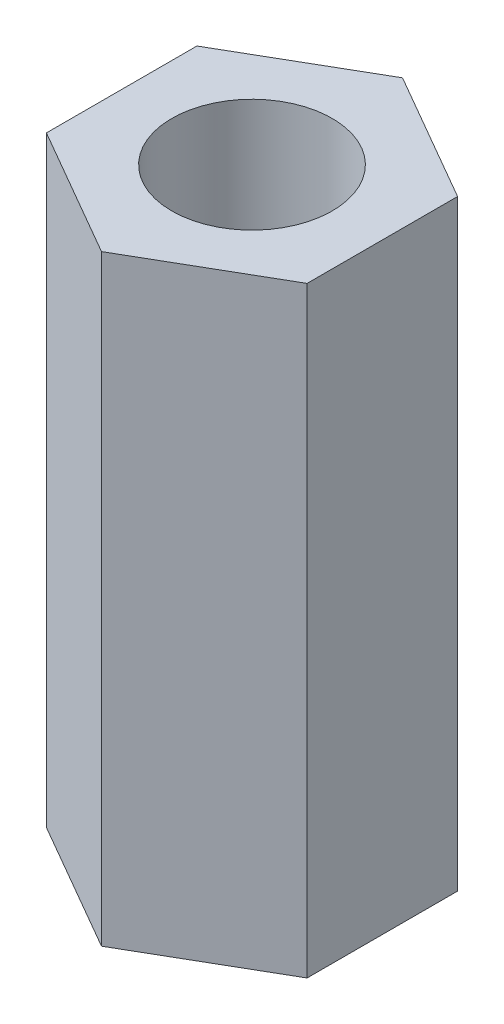
ISO-10303-21;
HEADER;
FILE_DESCRIPTION(('STEP AP214'),'2;1');
FILE_NAME('part.step','',(''),(''),'','','');
FILE_SCHEMA(('AUTOMOTIVE_DESIGN { 1 0 10303 214 1 1 1 1 }'));
ENDSEC;
DATA;
#1=APPLICATION_CONTEXT('core data for automotive mechanical design processes');
#2=APPLICATION_PROTOCOL_DEFINITION('international standard','automotive_design',2000,#1);
#3=PRODUCT_CONTEXT('',#1,'mechanical');
#4=PRODUCT('Part','Part','',(#3));
#5=PRODUCT_RELATED_PRODUCT_CATEGORY('part','',(#4));
#6=PRODUCT_DEFINITION_FORMATION('','',#4);
#7=PRODUCT_DEFINITION_CONTEXT('part definition',#1,'design');
#8=PRODUCT_DEFINITION('design','',#6,#7);
#9=PRODUCT_DEFINITION_SHAPE('','',#8);
#10=(LENGTH_UNIT() NAMED_UNIT(*) SI_UNIT(.MILLI.,.METRE.));
#11=(NAMED_UNIT(*) PLANE_ANGLE_UNIT() SI_UNIT($,.RADIAN.));
#12=(NAMED_UNIT(*) SI_UNIT($,.STERADIAN.) SOLID_ANGLE_UNIT());
#13=UNCERTAINTY_MEASURE_WITH_UNIT(LENGTH_MEASURE(1.E-05),#10,'distance_accuracy_value','');
#14=(GEOMETRIC_REPRESENTATION_CONTEXT(3) GLOBAL_UNCERTAINTY_ASSIGNED_CONTEXT((#13)) GLOBAL_UNIT_ASSIGNED_CONTEXT((#10,
#11,#12)) REPRESENTATION_CONTEXT('',''));
#15=CARTESIAN_POINT('',(0.,0.,0.));
#16=DIRECTION('',(0.,0.,1.));
#17=DIRECTION('',(1.,0.,0.));
#18=AXIS2_PLACEMENT_3D('',#15,#16,#17);
#19=CARTESIAN_POINT('',(0.,30.,0.));
#20=DIRECTION('',(0.,1.,0.));
#21=DIRECTION('',(0.,0.,1.));
#22=AXIS2_PLACEMENT_3D('',#19,#20,#21);
#23=PLANE('',#22);
#24=DIRECTION('',(-0.866025403784439,0.,-0.5));
#25=VECTOR('',#24,1.);
#26=CARTESIAN_POINT('',(6.5,30.,-3.75277674973257));
#27=LINE('',#26,#25);
#28=CARTESIAN_POINT('',(6.5,30.,-3.75277674973257));
#29=VERTEX_POINT('',#28);
#30=CARTESIAN_POINT('',(0.,30.,-7.50555349946513));
#31=VERTEX_POINT('',#30);
#32=EDGE_CURVE('E131',#29,#31,#27,.T.);
#33=ORIENTED_EDGE('',*,*,#32,.T.);
#34=DIRECTION('',(-0.866025403784439,0.,0.5));
#35=VECTOR('',#34,1.);
#36=CARTESIAN_POINT('',(0.,30.,-7.50555349946513));
#37=LINE('',#36,#35);
#38=CARTESIAN_POINT('',(-6.5,30.,-3.75277674973257));
#39=VERTEX_POINT('',#38);
#40=EDGE_CURVE('E89',#31,#39,#37,.T.);
#41=ORIENTED_EDGE('',*,*,#40,.T.);
#42=DIRECTION('',(0.,0.,1.));
#43=VECTOR('',#42,1.);
#44=CARTESIAN_POINT('',(-6.5,30.,-3.75277674973257));
#45=LINE('',#44,#43);
#46=CARTESIAN_POINT('',(-6.5,30.,3.75277674973257));
#47=VERTEX_POINT('',#46);
#48=EDGE_CURVE('E102',#39,#47,#45,.T.);
#49=ORIENTED_EDGE('',*,*,#48,.T.);
#50=DIRECTION('',(0.866025403784439,0.,0.5));
#51=VECTOR('',#50,1.);
#52=CARTESIAN_POINT('',(-6.5,30.,3.75277674973257));
#53=LINE('',#52,#51);
#54=CARTESIAN_POINT('',(0.,30.,7.50555349946513));
#55=VERTEX_POINT('',#54);
#56=EDGE_CURVE('E96',#47,#55,#53,.T.);
#57=ORIENTED_EDGE('',*,*,#56,.T.);
#58=DIRECTION('',(0.866025403784439,0.,-0.5));
#59=VECTOR('',#58,1.);
#60=CARTESIAN_POINT('',(0.,30.,7.50555349946513));
#61=LINE('',#60,#59);
#62=CARTESIAN_POINT('',(6.5,30.,3.75277674973257));
#63=VERTEX_POINT('',#62);
#64=EDGE_CURVE('E100',#55,#63,#61,.T.);
#65=ORIENTED_EDGE('',*,*,#64,.T.);
#66=DIRECTION('',(0.,0.,-1.));
#67=VECTOR('',#66,1.);
#68=CARTESIAN_POINT('',(6.5,30.,3.75277674973257));
#69=LINE('',#68,#67);
#70=EDGE_CURVE('E52',#63,#29,#69,.T.);
#71=ORIENTED_EDGE('',*,*,#70,.T.);
#72=EDGE_LOOP('',(#33,#41,#49,#57,#65,#71));
#73=FACE_BOUND('',#72,.T.);
#74=CARTESIAN_POINT('',(0.,30.,0.));
#75=DIRECTION('',(0.,1.,0.));
#76=DIRECTION('',(0.,0.,1.));
#77=AXIS2_PLACEMENT_3D('',#74,#75,#76);
#78=CIRCLE('',#77,4.);
#79=CARTESIAN_POINT('',(0.,30.,4.));
#80=VERTEX_POINT('',#79);
#81=EDGE_CURVE('E124',#80,#80,#78,.T.);
#82=ORIENTED_EDGE('',*,*,#81,.F.);
#83=EDGE_LOOP('',(#82));
#84=FACE_BOUND('',#83,.T.);
#85=ADVANCED_FACE('F35',(#73,#84),#23,.T.);
#86=CARTESIAN_POINT('',(0.,0.,0.));
#87=DIRECTION('',(0.,1.,0.));
#88=DIRECTION('',(0.,0.,1.));
#89=AXIS2_PLACEMENT_3D('',#86,#87,#88);
#90=PLANE('',#89);
#91=DIRECTION('',(-0.866025403784439,0.,-0.5));
#92=VECTOR('',#91,1.);
#93=CARTESIAN_POINT('',(6.5,0.,-3.75277674973257));
#94=LINE('',#93,#92);
#95=CARTESIAN_POINT('',(6.5,0.,-3.75277674973257));
#96=VERTEX_POINT('',#95);
#97=CARTESIAN_POINT('',(0.,0.,-7.50555349946513));
#98=VERTEX_POINT('',#97);
#99=EDGE_CURVE('E120',#96,#98,#94,.T.);
#100=ORIENTED_EDGE('',*,*,#99,.F.);
#101=DIRECTION('',(0.,0.,-1.));
#102=VECTOR('',#101,1.);
#103=CARTESIAN_POINT('',(6.5,0.,3.75277674973257));
#104=LINE('',#103,#102);
#105=CARTESIAN_POINT('',(6.5,0.,3.75277674973257));
#106=VERTEX_POINT('',#105);
#107=EDGE_CURVE('E81',#106,#96,#104,.T.);
#108=ORIENTED_EDGE('',*,*,#107,.F.);
#109=DIRECTION('',(0.866025403784439,0.,-0.5));
#110=VECTOR('',#109,1.);
#111=CARTESIAN_POINT('',(0.,0.,7.50555349946513));
#112=LINE('',#111,#110);
#113=CARTESIAN_POINT('',(0.,0.,7.50555349946513));
#114=VERTEX_POINT('',#113);
#115=EDGE_CURVE('E75',#114,#106,#112,.T.);
#116=ORIENTED_EDGE('',*,*,#115,.F.);
#117=DIRECTION('',(0.866025403784439,0.,0.5));
#118=VECTOR('',#117,1.);
#119=CARTESIAN_POINT('',(-6.5,0.,3.75277674973257));
#120=LINE('',#119,#118);
#121=CARTESIAN_POINT('',(-6.5,0.,3.75277674973257));
#122=VERTEX_POINT('',#121);
#123=EDGE_CURVE('E110',#122,#114,#120,.T.);
#124=ORIENTED_EDGE('',*,*,#123,.F.);
#125=DIRECTION('',(0.,0.,1.));
#126=VECTOR('',#125,1.);
#127=CARTESIAN_POINT('',(-6.5,0.,-3.75277674973257));
#128=LINE('',#127,#126);
#129=CARTESIAN_POINT('',(-6.5,0.,-3.75277674973257));
#130=VERTEX_POINT('',#129);
#131=EDGE_CURVE('E126',#130,#122,#128,.T.);
#132=ORIENTED_EDGE('',*,*,#131,.F.);
#133=DIRECTION('',(-0.866025403784439,0.,0.5));
#134=VECTOR('',#133,1.);
#135=CARTESIAN_POINT('',(0.,0.,-7.50555349946513));
#136=LINE('',#135,#134);
#137=EDGE_CURVE('E123',#98,#130,#136,.T.);
#138=ORIENTED_EDGE('',*,*,#137,.F.);
#139=EDGE_LOOP('',(#100,#108,#116,#124,#132,#138));
#140=FACE_BOUND('',#139,.T.);
#141=CARTESIAN_POINT('',(0.,0.,0.));
#142=DIRECTION('',(0.,1.,0.));
#143=DIRECTION('',(0.,0.,1.));
#144=AXIS2_PLACEMENT_3D('',#141,#142,#143);
#145=CIRCLE('',#144,4.);
#146=CARTESIAN_POINT('',(0.,0.,4.));
#147=VERTEX_POINT('',#146);
#148=EDGE_CURVE('E224',#147,#147,#145,.T.);
#149=ORIENTED_EDGE('',*,*,#148,.T.);
#150=EDGE_LOOP('',(#149));
#151=FACE_BOUND('',#150,.T.);
#152=ADVANCED_FACE('F140',(#140,#151),#90,.F.);
#153=CARTESIAN_POINT('',(6.5,30.,-3.75277674973257));
#154=DIRECTION('',(-0.5,0.,0.866025403784439));
#155=DIRECTION('',(0.866025403784439,0.,0.5));
#156=AXIS2_PLACEMENT_3D('',#153,#154,#155);
#157=PLANE('',#156);
#158=ORIENTED_EDGE('',*,*,#99,.T.);
#159=DIRECTION('',(0.,-1.,0.));
#160=VECTOR('',#159,1.);
#161=CARTESIAN_POINT('',(0.,30.,-7.50555349946513));
#162=LINE('',#161,#160);
#163=EDGE_CURVE('E11',#31,#98,#162,.T.);
#164=ORIENTED_EDGE('',*,*,#163,.F.);
#165=ORIENTED_EDGE('',*,*,#32,.F.);
#166=DIRECTION('',(0.,-1.,0.));
#167=VECTOR('',#166,1.);
#168=CARTESIAN_POINT('',(6.5,30.,-3.75277674973257));
#169=LINE('',#168,#167);
#170=EDGE_CURVE('E116',#29,#96,#169,.T.);
#171=ORIENTED_EDGE('',*,*,#170,.T.);
#172=EDGE_LOOP('',(#158,#164,#165,#171));
#173=FACE_BOUND('',#172,.T.);
#174=ADVANCED_FACE('F37',(#173),#157,.F.);
#175=CARTESIAN_POINT('',(0.,30.,-7.50555349946513));
#176=DIRECTION('',(0.5,0.,0.866025403784439));
#177=DIRECTION('',(0.866025403784439,0.,-0.5));
#178=AXIS2_PLACEMENT_3D('',#175,#176,#177);
#179=PLANE('',#178);
#180=ORIENTED_EDGE('',*,*,#137,.T.);
#181=DIRECTION('',(0.,-1.,0.));
#182=VECTOR('',#181,1.);
#183=CARTESIAN_POINT('',(-6.5,30.,-3.75277674973257));
#184=LINE('',#183,#182);
#185=EDGE_CURVE('E44',#39,#130,#184,.T.);
#186=ORIENTED_EDGE('',*,*,#185,.F.);
#187=ORIENTED_EDGE('',*,*,#40,.F.);
#188=ORIENTED_EDGE('',*,*,#163,.T.);
#189=EDGE_LOOP('',(#180,#186,#187,#188));
#190=FACE_BOUND('',#189,.T.);
#191=ADVANCED_FACE('F165',(#190),#179,.F.);
#192=CARTESIAN_POINT('',(-6.5,30.,-3.75277674973257));
#193=DIRECTION('',(1.,0.,0.));
#194=DIRECTION('',(0.,0.,-1.));
#195=AXIS2_PLACEMENT_3D('',#192,#193,#194);
#196=PLANE('',#195);
#197=ORIENTED_EDGE('',*,*,#131,.T.);
#198=DIRECTION('',(0.,-1.,0.));
#199=VECTOR('',#198,1.);
#200=CARTESIAN_POINT('',(-6.5,30.,3.75277674973257));
#201=LINE('',#200,#199);
#202=EDGE_CURVE('E111',#47,#122,#201,.T.);
#203=ORIENTED_EDGE('',*,*,#202,.F.);
#204=ORIENTED_EDGE('',*,*,#48,.F.);
#205=ORIENTED_EDGE('',*,*,#185,.T.);
#206=EDGE_LOOP('',(#197,#203,#204,#205));
#207=FACE_BOUND('',#206,.T.);
#208=ADVANCED_FACE('F137',(#207),#196,.F.);
#209=CARTESIAN_POINT('',(-6.5,30.,3.75277674973257));
#210=DIRECTION('',(0.5,0.,-0.866025403784439));
#211=DIRECTION('',(-0.866025403784439,0.,-0.5));
#212=AXIS2_PLACEMENT_3D('',#209,#210,#211);
#213=PLANE('',#212);
#214=ORIENTED_EDGE('',*,*,#123,.T.);
#215=DIRECTION('',(0.,-1.,0.));
#216=VECTOR('',#215,1.);
#217=CARTESIAN_POINT('',(0.,30.,7.50555349946513));
#218=LINE('',#217,#216);
#219=EDGE_CURVE('E107',#55,#114,#218,.T.);
#220=ORIENTED_EDGE('',*,*,#219,.F.);
#221=ORIENTED_EDGE('',*,*,#56,.F.);
#222=ORIENTED_EDGE('',*,*,#202,.T.);
#223=EDGE_LOOP('',(#214,#220,#221,#222));
#224=FACE_BOUND('',#223,.T.);
#225=ADVANCED_FACE('F108',(#224),#213,.F.);
#226=CARTESIAN_POINT('',(0.,30.,7.50555349946513));
#227=DIRECTION('',(-0.5,0.,-0.866025403784439));
#228=DIRECTION('',(-0.866025403784439,0.,0.5));
#229=AXIS2_PLACEMENT_3D('',#226,#227,#228);
#230=PLANE('',#229);
#231=ORIENTED_EDGE('',*,*,#115,.T.);
#232=DIRECTION('',(0.,-1.,0.));
#233=VECTOR('',#232,1.);
#234=CARTESIAN_POINT('',(6.5,30.,3.75277674973257));
#235=LINE('',#234,#233);
#236=EDGE_CURVE('E112',#63,#106,#235,.T.);
#237=ORIENTED_EDGE('',*,*,#236,.F.);
#238=ORIENTED_EDGE('',*,*,#64,.F.);
#239=ORIENTED_EDGE('',*,*,#219,.T.);
#240=EDGE_LOOP('',(#231,#237,#238,#239));
#241=FACE_BOUND('',#240,.T.);
#242=ADVANCED_FACE('F114',(#241),#230,.F.);
#243=CARTESIAN_POINT('',(6.5,30.,3.75277674973257));
#244=DIRECTION('',(-1.,0.,0.));
#245=DIRECTION('',(0.,0.,1.));
#246=AXIS2_PLACEMENT_3D('',#243,#244,#245);
#247=PLANE('',#246);
#248=ORIENTED_EDGE('',*,*,#107,.T.);
#249=ORIENTED_EDGE('',*,*,#170,.F.);
#250=ORIENTED_EDGE('',*,*,#70,.F.);
#251=ORIENTED_EDGE('',*,*,#236,.T.);
#252=EDGE_LOOP('',(#248,#249,#250,#251));
#253=FACE_BOUND('',#252,.T.);
#254=ADVANCED_FACE('F145',(#253),#247,.F.);
#255=CARTESIAN_POINT('',(0.,30.,0.));
#256=DIRECTION('',(0.,-1.,0.));
#257=DIRECTION('',(0.,0.,-1.));
#258=AXIS2_PLACEMENT_3D('',#255,#256,#257);
#259=CYLINDRICAL_SURFACE('',#258,4.);
#260=ORIENTED_EDGE('',*,*,#81,.T.);
#261=EDGE_LOOP('',(#260));
#262=FACE_BOUND('',#261,.T.);
#263=ORIENTED_EDGE('',*,*,#148,.F.);
#264=EDGE_LOOP('',(#263));
#265=FACE_BOUND('',#264,.T.);
#266=ADVANCED_FACE('F147',(#262,#265),#259,.F.);
#267=CLOSED_SHELL('',(#85,#152,#174,#191,#208,#225,#242,#254,#266));
#268=MANIFOLD_SOLID_BREP('B2',#267);
#269=ADVANCED_BREP_SHAPE_REPRESENTATION('',(#18,#268),#14);
#270=SHAPE_DEFINITION_REPRESENTATION(#9,#269);
ENDSEC;
END-ISO-10303-21;
